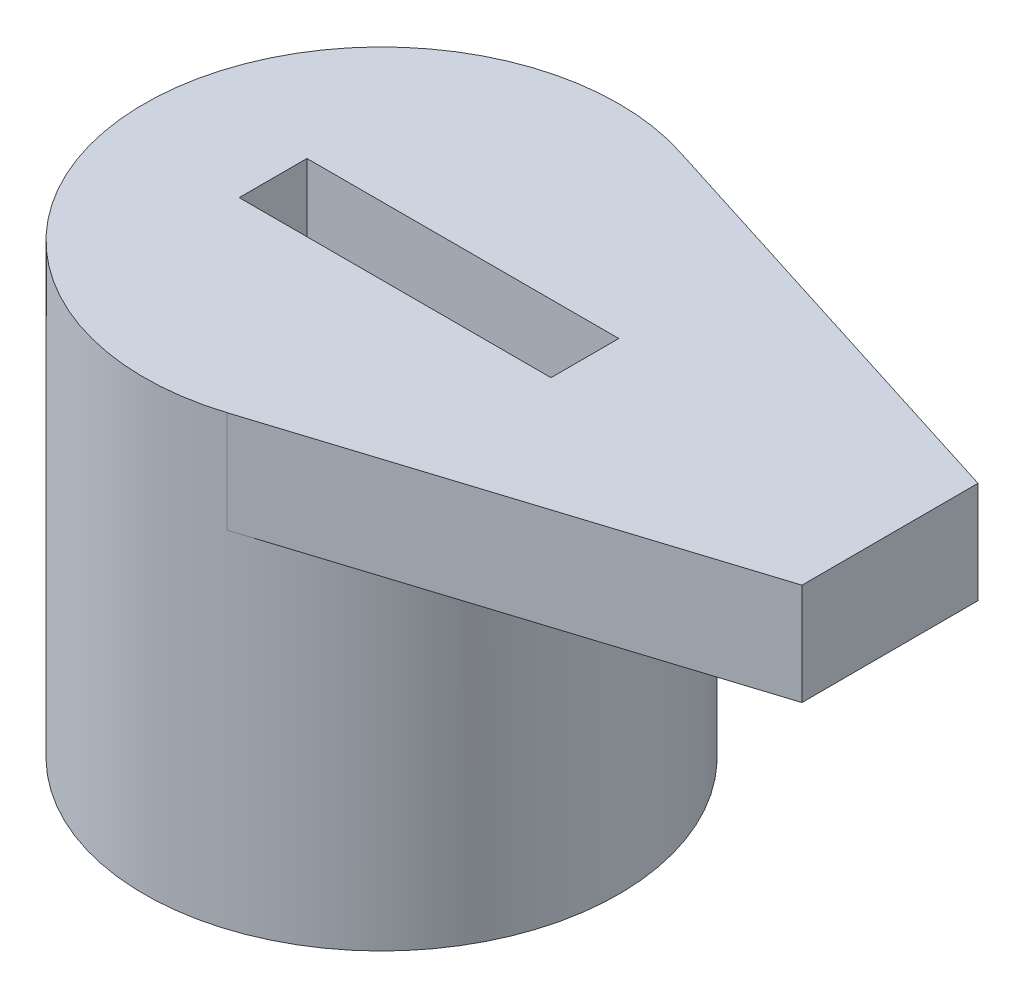
ISO-10303-21;
HEADER;
FILE_DESCRIPTION(('STEP AP214'),'2;1');
FILE_NAME('part.step','',(''),(''),'','','');
FILE_SCHEMA(('AUTOMOTIVE_DESIGN { 1 0 10303 214 1 1 1 1 }'));
ENDSEC;
DATA;
#1=APPLICATION_CONTEXT('core data for automotive mechanical design processes');
#2=APPLICATION_PROTOCOL_DEFINITION('international standard','automotive_design',2000,#1);
#3=PRODUCT_CONTEXT('',#1,'mechanical');
#4=PRODUCT('Part','Part','',(#3));
#5=PRODUCT_RELATED_PRODUCT_CATEGORY('part','',(#4));
#6=PRODUCT_DEFINITION_FORMATION('','',#4);
#7=PRODUCT_DEFINITION_CONTEXT('part definition',#1,'design');
#8=PRODUCT_DEFINITION('design','',#6,#7);
#9=PRODUCT_DEFINITION_SHAPE('','',#8);
#10=(LENGTH_UNIT() NAMED_UNIT(*) SI_UNIT(.MILLI.,.METRE.));
#11=(NAMED_UNIT(*) PLANE_ANGLE_UNIT() SI_UNIT($,.RADIAN.));
#12=(NAMED_UNIT(*) SI_UNIT($,.STERADIAN.) SOLID_ANGLE_UNIT());
#13=UNCERTAINTY_MEASURE_WITH_UNIT(LENGTH_MEASURE(1.E-05),#10,'distance_accuracy_value','');
#14=(GEOMETRIC_REPRESENTATION_CONTEXT(3) GLOBAL_UNCERTAINTY_ASSIGNED_CONTEXT((#13)) GLOBAL_UNIT_ASSIGNED_CONTEXT((#10,
#11,#12)) REPRESENTATION_CONTEXT('',''));
#15=CARTESIAN_POINT('',(0.,0.,0.));
#16=DIRECTION('',(0.,0.,1.));
#17=DIRECTION('',(1.,0.,0.));
#18=AXIS2_PLACEMENT_3D('',#15,#16,#17);
#19=CARTESIAN_POINT('',(-5.86092041698449,20.9504195270786,53.));
#20=DIRECTION('',(0.,1.,0.));
#21=DIRECTION('',(0.,0.,1.));
#22=AXIS2_PLACEMENT_3D('',#19,#20,#21);
#23=PLANE('',#22);
#24=DIRECTION('',(0.,0.,1.));
#25=VECTOR('',#24,1.);
#26=CARTESIAN_POINT('',(-7.46092041698448,20.9504195270786,52.5));
#27=LINE('',#26,#25);
#28=CARTESIAN_POINT('',(-7.46092041698448,20.9504195270786,52.5));
#29=VERTEX_POINT('',#28);
#30=CARTESIAN_POINT('',(-7.46092041698448,20.9504195270786,53.5));
#31=VERTEX_POINT('',#30);
#32=EDGE_CURVE('E93',#29,#31,#27,.T.);
#33=ORIENTED_EDGE('',*,*,#32,.T.);
#34=DIRECTION('',(1.,0.,0.));
#35=VECTOR('',#34,1.);
#36=CARTESIAN_POINT('',(-7.46092041698448,20.9504195270786,53.5));
#37=LINE('',#36,#35);
#38=CARTESIAN_POINT('',(-2.86092041698448,20.9504195270786,53.5));
#39=VERTEX_POINT('',#38);
#40=EDGE_CURVE('E95',#31,#39,#37,.T.);
#41=ORIENTED_EDGE('',*,*,#40,.T.);
#42=DIRECTION('',(0.,0.,1.));
#43=VECTOR('',#42,1.);
#44=CARTESIAN_POINT('',(-2.86092041698448,20.9504195270786,52.5));
#45=LINE('',#44,#43);
#46=CARTESIAN_POINT('',(-2.86092041698448,20.9504195270786,52.5));
#47=VERTEX_POINT('',#46);
#48=EDGE_CURVE('E97',#39,#47,#45,.F.);
#49=ORIENTED_EDGE('',*,*,#48,.T.);
#50=DIRECTION('',(1.,0.,0.));
#51=VECTOR('',#50,1.);
#52=CARTESIAN_POINT('',(-7.46092041698448,20.9504195270786,52.5));
#53=LINE('',#52,#51);
#54=EDGE_CURVE('E168',#47,#29,#53,.F.);
#55=ORIENTED_EDGE('',*,*,#54,.T.);
#56=EDGE_LOOP('',(#33,#41,#49,#55));
#57=FACE_BOUND('',#56,.T.);
#58=ADVANCED_FACE('F18',(#57),#23,.T.);
#59=CARTESIAN_POINT('',(-2.86092041698448,20.9504195270786,52.5));
#60=DIRECTION('',(1.,0.,0.));
#61=DIRECTION('',(0.,1.,0.));
#62=AXIS2_PLACEMENT_3D('',#59,#60,#61);
#63=PLANE('',#62);
#64=ORIENTED_EDGE('',*,*,#48,.F.);
#65=DIRECTION('',(0.,-1.,0.));
#66=VECTOR('',#65,1.);
#67=CARTESIAN_POINT('',(-2.86092041698448,20.9504195270786,53.5));
#68=LINE('',#67,#66);
#69=CARTESIAN_POINT('',(-2.86092041698448,22.4504195270786,53.5));
#70=VERTEX_POINT('',#69);
#71=EDGE_CURVE('E102',#39,#70,#68,.F.);
#72=ORIENTED_EDGE('',*,*,#71,.T.);
#73=DIRECTION('',(0.,0.,1.));
#74=VECTOR('',#73,1.);
#75=CARTESIAN_POINT('',(-2.86092041698448,22.4504195270786,53.));
#76=LINE('',#75,#74);
#77=CARTESIAN_POINT('',(-2.86092041698448,22.4504195270786,52.5));
#78=VERTEX_POINT('',#77);
#79=EDGE_CURVE('E78',#78,#70,#76,.T.);
#80=ORIENTED_EDGE('',*,*,#79,.F.);
#81=DIRECTION('',(0.,1.,0.));
#82=VECTOR('',#81,1.);
#83=CARTESIAN_POINT('',(-2.86092041698448,20.9504195270786,52.5));
#84=LINE('',#83,#82);
#85=EDGE_CURVE('E106',#78,#47,#84,.F.);
#86=ORIENTED_EDGE('',*,*,#85,.T.);
#87=EDGE_LOOP('',(#64,#72,#80,#86));
#88=FACE_BOUND('',#87,.T.);
#89=ADVANCED_FACE('F104',(#88),#63,.F.);
#90=CARTESIAN_POINT('',(-7.46092041698448,20.9504195270786,53.5));
#91=DIRECTION('',(0.,0.,1.));
#92=DIRECTION('',(0.,-1.,0.));
#93=AXIS2_PLACEMENT_3D('',#90,#91,#92);
#94=PLANE('',#93);
#95=ORIENTED_EDGE('',*,*,#40,.F.);
#96=DIRECTION('',(0.,1.,0.));
#97=VECTOR('',#96,1.);
#98=CARTESIAN_POINT('',(-7.46092041698448,20.9504195270786,53.5));
#99=LINE('',#98,#97);
#100=CARTESIAN_POINT('',(-7.46092041698448,22.4504195270786,53.5));
#101=VERTEX_POINT('',#100);
#102=EDGE_CURVE('E113',#31,#101,#99,.T.);
#103=ORIENTED_EDGE('',*,*,#102,.T.);
#104=DIRECTION('',(1.,0.,0.));
#105=VECTOR('',#104,1.);
#106=CARTESIAN_POINT('',(-5.86092041698449,22.4504195270786,53.5));
#107=LINE('',#106,#105);
#108=EDGE_CURVE('E111',#70,#101,#107,.F.);
#109=ORIENTED_EDGE('',*,*,#108,.F.);
#110=ORIENTED_EDGE('',*,*,#71,.F.);
#111=EDGE_LOOP('',(#95,#103,#109,#110));
#112=FACE_BOUND('',#111,.T.);
#113=ADVANCED_FACE('F109',(#112),#94,.F.);
#114=CARTESIAN_POINT('',(-7.46092041698448,20.9504195270786,52.5));
#115=DIRECTION('',(-1.,0.,0.));
#116=DIRECTION('',(0.,0.,1.));
#117=AXIS2_PLACEMENT_3D('',#114,#115,#116);
#118=PLANE('',#117);
#119=ORIENTED_EDGE('',*,*,#32,.F.);
#120=DIRECTION('',(0.,1.,0.));
#121=VECTOR('',#120,1.);
#122=CARTESIAN_POINT('',(-7.46092041698448,20.9504195270786,52.5));
#123=LINE('',#122,#121);
#124=CARTESIAN_POINT('',(-7.46092041698448,22.4504195270786,52.5));
#125=VERTEX_POINT('',#124);
#126=EDGE_CURVE('E164',#29,#125,#123,.T.);
#127=ORIENTED_EDGE('',*,*,#126,.T.);
#128=DIRECTION('',(0.,0.,1.));
#129=VECTOR('',#128,1.);
#130=CARTESIAN_POINT('',(-7.46092041698448,22.4504195270786,53.));
#131=LINE('',#130,#129);
#132=EDGE_CURVE('E141',#101,#125,#131,.F.);
#133=ORIENTED_EDGE('',*,*,#132,.F.);
#134=ORIENTED_EDGE('',*,*,#102,.F.);
#135=EDGE_LOOP('',(#119,#127,#133,#134));
#136=FACE_BOUND('',#135,.T.);
#137=ADVANCED_FACE('F172',(#136),#118,.F.);
#138=CARTESIAN_POINT('',(-7.46092041698448,20.9504195270786,52.5));
#139=DIRECTION('',(0.,0.,-1.));
#140=DIRECTION('',(0.,1.,0.));
#141=AXIS2_PLACEMENT_3D('',#138,#139,#140);
#142=PLANE('',#141);
#143=ORIENTED_EDGE('',*,*,#54,.F.);
#144=ORIENTED_EDGE('',*,*,#85,.F.);
#145=DIRECTION('',(1.,0.,0.));
#146=VECTOR('',#145,1.);
#147=CARTESIAN_POINT('',(-5.86092041698449,22.4504195270786,52.5));
#148=LINE('',#147,#146);
#149=EDGE_CURVE('E138',#125,#78,#148,.T.);
#150=ORIENTED_EDGE('',*,*,#149,.F.);
#151=ORIENTED_EDGE('',*,*,#126,.F.);
#152=EDGE_LOOP('',(#143,#144,#150,#151));
#153=FACE_BOUND('',#152,.T.);
#154=ADVANCED_FACE('F179',(#153),#142,.F.);
#155=CARTESIAN_POINT('',(1.63748133735521,22.4504195270786,51.7));
#156=DIRECTION('',(-0.999999238856131,0.,0.0012338100175612));
#157=DIRECTION('',(0.0012338100175612,0.,0.999999238856131));
#158=AXIS2_PLACEMENT_3D('',#155,#156,#157);
#159=PLANE('',#158);
#160=DIRECTION('',(-0.00123381001756222,0.,-0.999999238856131));
#161=VECTOR('',#160,1.);
#162=CARTESIAN_POINT('',(1.64068924584255,22.4504195270786,54.3));
#163=LINE('',#162,#161);
#164=CARTESIAN_POINT('',(1.64068924584255,22.4504195270786,54.3));
#165=VERTEX_POINT('',#164);
#166=CARTESIAN_POINT('',(1.63748133735521,22.4504195270786,51.7));
#167=VERTEX_POINT('',#166);
#168=EDGE_CURVE('E117',#165,#167,#163,.T.);
#169=ORIENTED_EDGE('',*,*,#168,.F.);
#170=DIRECTION('',(0.,1.,0.));
#171=VECTOR('',#170,1.);
#172=CARTESIAN_POINT('',(1.64068924584255,22.4504195270786,54.3));
#173=LINE('',#172,#171);
#174=CARTESIAN_POINT('',(1.64068924584255,20.9504195270786,54.3));
#175=VERTEX_POINT('',#174);
#176=EDGE_CURVE('E57',#165,#175,#173,.F.);
#177=ORIENTED_EDGE('',*,*,#176,.T.);
#178=DIRECTION('',(-0.00123381001756188,0.,-0.999999238856131));
#179=VECTOR('',#178,1.);
#180=CARTESIAN_POINT('',(1.64068924584255,20.9504195270786,54.3));
#181=LINE('',#180,#179);
#182=CARTESIAN_POINT('',(1.63748133735521,20.9504195270786,51.7));
#183=VERTEX_POINT('',#182);
#184=EDGE_CURVE('E51',#175,#183,#181,.T.);
#185=ORIENTED_EDGE('',*,*,#184,.T.);
#186=DIRECTION('',(0.,1.,0.));
#187=VECTOR('',#186,1.);
#188=CARTESIAN_POINT('',(1.63748133735521,22.4504195270786,51.7));
#189=LINE('',#188,#187);
#190=EDGE_CURVE('E69',#183,#167,#189,.T.);
#191=ORIENTED_EDGE('',*,*,#190,.T.);
#192=EDGE_LOOP('',(#169,#177,#185,#191));
#193=FACE_BOUND('',#192,.T.);
#194=ADVANCED_FACE('F181',(#193),#159,.F.);
#195=CARTESIAN_POINT('',(1.63748133735521,22.4504195270786,51.7));
#196=DIRECTION('',(-0.301461317205613,0.,0.95347840784606));
#197=DIRECTION('',(0.95347840784606,0.,0.301461317205613));
#198=AXIS2_PLACEMENT_3D('',#195,#196,#197);
#199=PLANE('',#198);
#200=DIRECTION('',(-0.953478407846059,0.,-0.301461317205614));
#201=VECTOR('',#200,1.);
#202=CARTESIAN_POINT('',(1.63748133735521,22.4504195270786,51.7));
#203=LINE('',#202,#201);
#204=CARTESIAN_POINT('',(-4.80580580676484,22.4504195270786,49.6628255725388));
#205=VERTEX_POINT('',#204);
#206=EDGE_CURVE('E120',#167,#205,#203,.T.);
#207=ORIENTED_EDGE('',*,*,#206,.F.);
#208=ORIENTED_EDGE('',*,*,#190,.F.);
#209=DIRECTION('',(-0.953478407846059,0.,-0.301461317205614));
#210=VECTOR('',#209,1.);
#211=CARTESIAN_POINT('',(1.63748133735521,20.9504195270786,51.7));
#212=LINE('',#211,#210);
#213=CARTESIAN_POINT('',(-4.80580580676484,20.9504195270786,49.6628255725388));
#214=VERTEX_POINT('',#213);
#215=EDGE_CURVE('E128',#183,#214,#212,.T.);
#216=ORIENTED_EDGE('',*,*,#215,.T.);
#217=DIRECTION('',(0.,1.,0.));
#218=VECTOR('',#217,1.);
#219=CARTESIAN_POINT('',(-4.80580580676484,22.4504195270786,49.6628255725388));
#220=LINE('',#219,#218);
#221=EDGE_CURVE('E35',#205,#214,#220,.F.);
#222=ORIENTED_EDGE('',*,*,#221,.F.);
#223=EDGE_LOOP('',(#207,#208,#216,#222));
#224=FACE_BOUND('',#223,.T.);
#225=ADVANCED_FACE('F188',(#224),#199,.F.);
#226=CARTESIAN_POINT('',(1.64068924584255,22.4504195270786,54.3));
#227=DIRECTION('',(-0.301324932706972,0.,-0.953521517811286));
#228=DIRECTION('',(-0.953521517811286,0.,0.301324932706972));
#229=AXIS2_PLACEMENT_3D('',#226,#227,#228);
#230=PLANE('',#229);
#231=DIRECTION('',(0.953521517811286,0.,-0.301324932706971));
#232=VECTOR('',#231,1.);
#233=CARTESIAN_POINT('',(-4.80628315251008,22.4504195270786,56.3373253123395));
#234=LINE('',#233,#232);
#235=CARTESIAN_POINT('',(-4.80628315251009,22.4504195270786,56.3373253123395));
#236=VERTEX_POINT('',#235);
#237=EDGE_CURVE('E121',#236,#165,#234,.T.);
#238=ORIENTED_EDGE('',*,*,#237,.F.);
#239=DIRECTION('',(0.,-1.,0.));
#240=VECTOR('',#239,1.);
#241=CARTESIAN_POINT('',(-4.80628315251008,15.8504195270786,56.3373253123395));
#242=LINE('',#241,#240);
#243=CARTESIAN_POINT('',(-4.80628315251008,20.9504195270786,56.3373253123395));
#244=VERTEX_POINT('',#243);
#245=EDGE_CURVE('E152',#244,#236,#242,.F.);
#246=ORIENTED_EDGE('',*,*,#245,.F.);
#247=DIRECTION('',(0.953521517811286,0.,-0.301324932706971));
#248=VECTOR('',#247,1.);
#249=CARTESIAN_POINT('',(-4.80628315251008,20.9504195270786,56.3373253123395));
#250=LINE('',#249,#248);
#251=EDGE_CURVE('E125',#244,#175,#250,.T.);
#252=ORIENTED_EDGE('',*,*,#251,.T.);
#253=ORIENTED_EDGE('',*,*,#176,.F.);
#254=EDGE_LOOP('',(#238,#246,#252,#253));
#255=FACE_BOUND('',#254,.T.);
#256=ADVANCED_FACE('F205',(#255),#230,.F.);
#257=CARTESIAN_POINT('',(-5.86092041698449,15.8504195270786,53.));
#258=DIRECTION('',(0.,1.,0.));
#259=DIRECTION('',(0.,0.,1.));
#260=AXIS2_PLACEMENT_3D('',#257,#258,#259);
#261=PLANE('',#260);
#262=CARTESIAN_POINT('',(-5.86092041698449,15.8504195270786,53.));
#263=DIRECTION('',(0.,-1.,0.));
#264=DIRECTION('',(0.,0.,-1.));
#265=AXIS2_PLACEMENT_3D('',#262,#263,#264);
#266=CIRCLE('',#265,3.5);
#267=CARTESIAN_POINT('',(-5.86092041698449,15.8504195270786,49.5));
#268=VERTEX_POINT('',#267);
#269=EDGE_CURVE('E21',#268,#268,#266,.F.);
#270=ORIENTED_EDGE('',*,*,#269,.F.);
#271=EDGE_LOOP('',(#270));
#272=FACE_BOUND('',#271,.T.);
#273=ADVANCED_FACE('F202',(#272),#261,.F.);
#274=CARTESIAN_POINT('',(-5.86092041698449,22.4504195270786,53.));
#275=DIRECTION('',(0.,1.,0.));
#276=DIRECTION('',(0.,0.,1.));
#277=AXIS2_PLACEMENT_3D('',#274,#275,#276);
#278=PLANE('',#277);
#279=ORIENTED_EDGE('',*,*,#132,.T.);
#280=ORIENTED_EDGE('',*,*,#149,.T.);
#281=ORIENTED_EDGE('',*,*,#79,.T.);
#282=ORIENTED_EDGE('',*,*,#108,.T.);
#283=EDGE_LOOP('',(#279,#280,#281,#282));
#284=FACE_BOUND('',#283,.T.);
#285=CARTESIAN_POINT('',(-5.86092041698449,22.4504195270786,53.));
#286=DIRECTION('',(0.,-1.,0.));
#287=DIRECTION('',(0.,0.,-1.));
#288=AXIS2_PLACEMENT_3D('',#285,#286,#287);
#289=CIRCLE('',#288,3.5);
#290=EDGE_CURVE('E27',#236,#205,#289,.T.);
#291=ORIENTED_EDGE('',*,*,#290,.F.);
#292=ORIENTED_EDGE('',*,*,#237,.T.);
#293=ORIENTED_EDGE('',*,*,#168,.T.);
#294=ORIENTED_EDGE('',*,*,#206,.T.);
#295=EDGE_LOOP('',(#291,#292,#293,#294));
#296=FACE_BOUND('',#295,.T.);
#297=ADVANCED_FACE('F176',(#284,#296),#278,.T.);
#298=CARTESIAN_POINT('',(-5.86092041698449,20.9504195270786,53.));
#299=DIRECTION('',(0.,1.,0.));
#300=DIRECTION('',(0.,0.,1.));
#301=AXIS2_PLACEMENT_3D('',#298,#299,#300);
#302=PLANE('',#301);
#303=ORIENTED_EDGE('',*,*,#251,.F.);
#304=CARTESIAN_POINT('',(-5.86092041698449,20.9504195270786,53.));
#305=DIRECTION('',(0.,-1.,0.));
#306=DIRECTION('',(0.,0.,-1.));
#307=AXIS2_PLACEMENT_3D('',#304,#305,#306);
#308=CIRCLE('',#307,3.5);
#309=EDGE_CURVE('E11',#214,#244,#308,.T.);
#310=ORIENTED_EDGE('',*,*,#309,.F.);
#311=ORIENTED_EDGE('',*,*,#215,.F.);
#312=ORIENTED_EDGE('',*,*,#184,.F.);
#313=EDGE_LOOP('',(#303,#310,#311,#312));
#314=FACE_BOUND('',#313,.T.);
#315=ADVANCED_FACE('F193',(#314),#302,.F.);
#316=CARTESIAN_POINT('',(-5.86092041698449,15.8504195270786,53.));
#317=DIRECTION('',(0.,-1.,0.));
#318=DIRECTION('',(0.,0.,-1.));
#319=AXIS2_PLACEMENT_3D('',#316,#317,#318);
#320=CYLINDRICAL_SURFACE('',#319,3.5);
#321=ORIENTED_EDGE('',*,*,#269,.T.);
#322=EDGE_LOOP('',(#321));
#323=FACE_BOUND('',#322,.T.);
#324=ORIENTED_EDGE('',*,*,#221,.T.);
#325=ORIENTED_EDGE('',*,*,#309,.T.);
#326=ORIENTED_EDGE('',*,*,#245,.T.);
#327=ORIENTED_EDGE('',*,*,#290,.T.);
#328=EDGE_LOOP('',(#324,#325,#326,#327));
#329=FACE_BOUND('',#328,.T.);
#330=ADVANCED_FACE('F191',(#323,#329),#320,.T.);
#331=CLOSED_SHELL('',(#58,#89,#113,#137,#154,#194,#225,#256,#273,#297,#315,#330));
#332=MANIFOLD_SOLID_BREP('B1',#331);
#333=ADVANCED_BREP_SHAPE_REPRESENTATION('',(#18,#332),#14);
#334=SHAPE_DEFINITION_REPRESENTATION(#9,#333);
ENDSEC;
END-ISO-10303-21;
